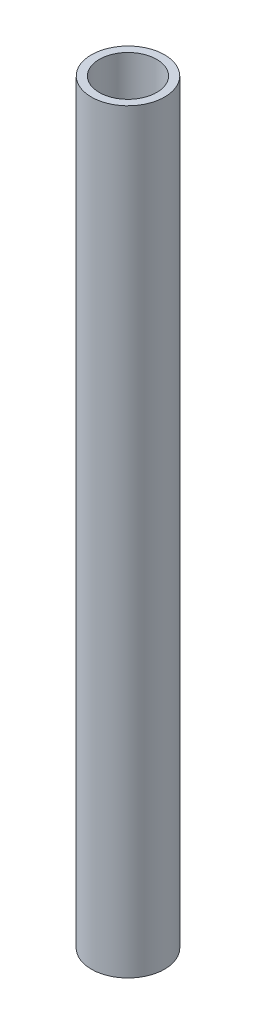
ISO-10303-21;
HEADER;
FILE_DESCRIPTION(('STEP AP214'),'2;1');
FILE_NAME('part.step','',(''),(''),'','','');
FILE_SCHEMA(('AUTOMOTIVE_DESIGN { 1 0 10303 214 1 1 1 1 }'));
ENDSEC;
DATA;
#1=APPLICATION_CONTEXT('core data for automotive mechanical design processes');
#2=APPLICATION_PROTOCOL_DEFINITION('international standard','automotive_design',2000,#1);
#3=PRODUCT_CONTEXT('',#1,'mechanical');
#4=PRODUCT('Part','Part','',(#3));
#5=PRODUCT_RELATED_PRODUCT_CATEGORY('part','',(#4));
#6=PRODUCT_DEFINITION_FORMATION('','',#4);
#7=PRODUCT_DEFINITION_CONTEXT('part definition',#1,'design');
#8=PRODUCT_DEFINITION('design','',#6,#7);
#9=PRODUCT_DEFINITION_SHAPE('','',#8);
#10=(LENGTH_UNIT() NAMED_UNIT(*) SI_UNIT(.MILLI.,.METRE.));
#11=(NAMED_UNIT(*) PLANE_ANGLE_UNIT() SI_UNIT($,.RADIAN.));
#12=(NAMED_UNIT(*) SI_UNIT($,.STERADIAN.) SOLID_ANGLE_UNIT());
#13=UNCERTAINTY_MEASURE_WITH_UNIT(LENGTH_MEASURE(1.E-05),#10,'distance_accuracy_value','');
#14=(GEOMETRIC_REPRESENTATION_CONTEXT(3) GLOBAL_UNCERTAINTY_ASSIGNED_CONTEXT((#13)) GLOBAL_UNIT_ASSIGNED_CONTEXT((#10,
#11,#12)) REPRESENTATION_CONTEXT('',''));
#15=CARTESIAN_POINT('',(0.,0.,0.));
#16=DIRECTION('',(0.,0.,1.));
#17=DIRECTION('',(1.,0.,0.));
#18=AXIS2_PLACEMENT_3D('',#15,#16,#17);
#19=CARTESIAN_POINT('',(0.,-165.,0.));
#20=DIRECTION('',(0.,1.,0.));
#21=DIRECTION('',(0.,0.,1.));
#22=AXIS2_PLACEMENT_3D('',#19,#20,#21);
#23=CYLINDRICAL_SURFACE('',#22,16.);
#24=CARTESIAN_POINT('',(0.,-165.,0.));
#25=DIRECTION('',(0.,1.,0.));
#26=DIRECTION('',(0.,0.,1.));
#27=AXIS2_PLACEMENT_3D('',#24,#25,#26);
#28=CIRCLE('',#27,16.);
#29=CARTESIAN_POINT('',(0.,-165.,16.));
#30=VERTEX_POINT('',#29);
#31=EDGE_CURVE('E10',#30,#30,#28,.T.);
#32=ORIENTED_EDGE('',*,*,#31,.T.);
#33=EDGE_LOOP('',(#32));
#34=FACE_BOUND('',#33,.T.);
#35=CARTESIAN_POINT('',(0.,165.,0.));
#36=DIRECTION('',(0.,1.,0.));
#37=DIRECTION('',(0.,0.,1.));
#38=AXIS2_PLACEMENT_3D('',#35,#36,#37);
#39=CIRCLE('',#38,16.);
#40=CARTESIAN_POINT('',(0.,165.,16.));
#41=VERTEX_POINT('',#40);
#42=EDGE_CURVE('E41',#41,#41,#39,.T.);
#43=ORIENTED_EDGE('',*,*,#42,.F.);
#44=EDGE_LOOP('',(#43));
#45=FACE_BOUND('',#44,.T.);
#46=ADVANCED_FACE('F34',(#34,#45),#23,.T.);
#47=CARTESIAN_POINT('',(0.,-165.,0.));
#48=DIRECTION('',(0.,1.,0.));
#49=DIRECTION('',(0.,0.,1.));
#50=AXIS2_PLACEMENT_3D('',#47,#48,#49);
#51=PLANE('',#50);
#52=CARTESIAN_POINT('',(0.,-165.,0.));
#53=DIRECTION('',(0.,1.,0.));
#54=DIRECTION('',(0.,0.,1.));
#55=AXIS2_PLACEMENT_3D('',#52,#53,#54);
#56=CIRCLE('',#55,12.5508248191542);
#57=CARTESIAN_POINT('',(0.,-165.,12.5508248191542));
#58=VERTEX_POINT('',#57);
#59=EDGE_CURVE('E45',#58,#58,#56,.F.);
#60=ORIENTED_EDGE('',*,*,#59,.F.);
#61=EDGE_LOOP('',(#60));
#62=FACE_BOUND('',#61,.T.);
#63=ORIENTED_EDGE('',*,*,#31,.F.);
#64=EDGE_LOOP('',(#63));
#65=FACE_BOUND('',#64,.T.);
#66=ADVANCED_FACE('F63',(#62,#65),#51,.F.);
#67=CARTESIAN_POINT('',(0.,165.,0.));
#68=DIRECTION('',(0.,1.,0.));
#69=DIRECTION('',(0.,0.,1.));
#70=AXIS2_PLACEMENT_3D('',#67,#68,#69);
#71=PLANE('',#70);
#72=CARTESIAN_POINT('',(0.,165.,0.));
#73=DIRECTION('',(0.,1.,0.));
#74=DIRECTION('',(0.,0.,1.));
#75=AXIS2_PLACEMENT_3D('',#72,#73,#74);
#76=CIRCLE('',#75,12.5508248191542);
#77=CARTESIAN_POINT('',(0.,165.,12.5508248191542));
#78=VERTEX_POINT('',#77);
#79=EDGE_CURVE('E37',#78,#78,#76,.F.);
#80=ORIENTED_EDGE('',*,*,#79,.T.);
#81=EDGE_LOOP('',(#80));
#82=FACE_BOUND('',#81,.T.);
#83=ORIENTED_EDGE('',*,*,#42,.T.);
#84=EDGE_LOOP('',(#83));
#85=FACE_BOUND('',#84,.T.);
#86=ADVANCED_FACE('F54',(#82,#85),#71,.T.);
#87=CARTESIAN_POINT('',(0.,210.5,0.));
#88=DIRECTION('',(0.,-1.,0.));
#89=DIRECTION('',(0.,0.,-1.));
#90=AXIS2_PLACEMENT_3D('',#87,#88,#89);
#91=CYLINDRICAL_SURFACE('',#90,12.5508248191542);
#92=ORIENTED_EDGE('',*,*,#79,.F.);
#93=EDGE_LOOP('',(#92));
#94=FACE_BOUND('',#93,.T.);
#95=ORIENTED_EDGE('',*,*,#59,.T.);
#96=EDGE_LOOP('',(#95));
#97=FACE_BOUND('',#96,.T.);
#98=ADVANCED_FACE('F57',(#94,#97),#91,.F.);
#99=CLOSED_SHELL('',(#46,#66,#86,#98));
#100=MANIFOLD_SOLID_BREP('B2',#99);
#101=ADVANCED_BREP_SHAPE_REPRESENTATION('',(#18,#100),#14);
#102=SHAPE_DEFINITION_REPRESENTATION(#9,#101);
ENDSEC;
END-ISO-10303-21;
